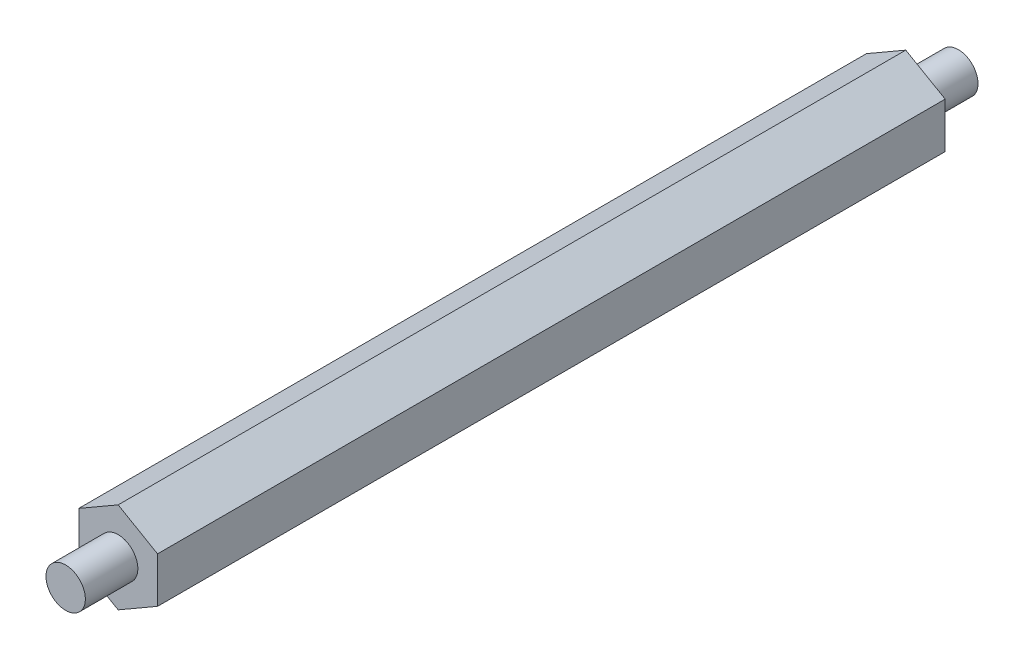
ISO-10303-21;
HEADER;
FILE_DESCRIPTION(('STEP AP214'),'2;1');
FILE_NAME('part.step','',(''),(''),'','','');
FILE_SCHEMA(('AUTOMOTIVE_DESIGN { 1 0 10303 214 1 1 1 1 }'));
ENDSEC;
DATA;
#1=APPLICATION_CONTEXT('core data for automotive mechanical design processes');
#2=APPLICATION_PROTOCOL_DEFINITION('international standard','automotive_design',2000,#1);
#3=PRODUCT_CONTEXT('',#1,'mechanical');
#4=PRODUCT('Part','Part','',(#3));
#5=PRODUCT_RELATED_PRODUCT_CATEGORY('part','',(#4));
#6=PRODUCT_DEFINITION_FORMATION('','',#4);
#7=PRODUCT_DEFINITION_CONTEXT('part definition',#1,'design');
#8=PRODUCT_DEFINITION('design','',#6,#7);
#9=PRODUCT_DEFINITION_SHAPE('','',#8);
#10=(LENGTH_UNIT() NAMED_UNIT(*) SI_UNIT(.MILLI.,.METRE.));
#11=(NAMED_UNIT(*) PLANE_ANGLE_UNIT() SI_UNIT($,.RADIAN.));
#12=(NAMED_UNIT(*) SI_UNIT($,.STERADIAN.) SOLID_ANGLE_UNIT());
#13=UNCERTAINTY_MEASURE_WITH_UNIT(LENGTH_MEASURE(1.E-05),#10,'distance_accuracy_value','');
#14=(GEOMETRIC_REPRESENTATION_CONTEXT(3) GLOBAL_UNCERTAINTY_ASSIGNED_CONTEXT((#13)) GLOBAL_UNIT_ASSIGNED_CONTEXT((#10,
#11,#12)) REPRESENTATION_CONTEXT('',''));
#15=CARTESIAN_POINT('',(0.,0.,0.));
#16=DIRECTION('',(0.,0.,1.));
#17=DIRECTION('',(1.,0.,0.));
#18=AXIS2_PLACEMENT_3D('',#15,#16,#17);
#19=CARTESIAN_POINT('',(2.08140106595602,1.86462753604946,60.));
#20=DIRECTION('',(-0.5,-0.866025403784439,0.));
#21=DIRECTION('',(0.866025403784439,-0.5,0.));
#22=AXIS2_PLACEMENT_3D('',#19,#20,#21);
#23=PLANE('',#22);
#24=DIRECTION('',(-0.866025403784439,0.5,0.));
#25=VECTOR('',#24,1.);
#26=CARTESIAN_POINT('',(2.08140106595602,1.86462753604946,0.));
#27=LINE('',#26,#25);
#28=CARTESIAN_POINT('',(2.08140106595602,1.86462753604946,0.));
#29=VERTEX_POINT('',#28);
#30=CARTESIAN_POINT('',(-0.918598934043976,3.59667834361834,0.));
#31=VERTEX_POINT('',#30);
#32=EDGE_CURVE('E117',#29,#31,#27,.T.);
#33=ORIENTED_EDGE('',*,*,#32,.T.);
#34=DIRECTION('',(0.,0.,-1.));
#35=VECTOR('',#34,1.);
#36=CARTESIAN_POINT('',(-0.918598934043976,3.59667834361834,60.));
#37=LINE('',#36,#35);
#38=CARTESIAN_POINT('',(-0.918598934043976,3.59667834361834,60.));
#39=VERTEX_POINT('',#38);
#40=EDGE_CURVE('E40',#39,#31,#37,.T.);
#41=ORIENTED_EDGE('',*,*,#40,.F.);
#42=DIRECTION('',(-0.866025403784439,0.5,0.));
#43=VECTOR('',#42,1.);
#44=CARTESIAN_POINT('',(2.08140106595602,1.86462753604946,60.));
#45=LINE('',#44,#43);
#46=CARTESIAN_POINT('',(2.08140106595602,1.86462753604946,60.));
#47=VERTEX_POINT('',#46);
#48=EDGE_CURVE('E128',#47,#39,#45,.T.);
#49=ORIENTED_EDGE('',*,*,#48,.F.);
#50=DIRECTION('',(0.,0.,-1.));
#51=VECTOR('',#50,1.);
#52=CARTESIAN_POINT('',(2.08140106595602,1.86462753604946,60.));
#53=LINE('',#52,#51);
#54=EDGE_CURVE('E113',#47,#29,#53,.T.);
#55=ORIENTED_EDGE('',*,*,#54,.T.);
#56=EDGE_LOOP('',(#33,#41,#49,#55));
#57=FACE_BOUND('',#56,.T.);
#58=ADVANCED_FACE('F32',(#57),#23,.F.);
#59=CARTESIAN_POINT('',(-0.918598934043976,3.59667834361834,60.));
#60=DIRECTION('',(0.5,-0.866025403784439,0.));
#61=DIRECTION('',(0.866025403784439,0.5,0.));
#62=AXIS2_PLACEMENT_3D('',#59,#60,#61);
#63=PLANE('',#62);
#64=DIRECTION('',(-0.866025403784439,-0.5,0.));
#65=VECTOR('',#64,1.);
#66=CARTESIAN_POINT('',(-0.918598934043976,3.59667834361834,0.));
#67=LINE('',#66,#65);
#68=CARTESIAN_POINT('',(-3.91859893404398,1.86462753604946,0.));
#69=VERTEX_POINT('',#68);
#70=EDGE_CURVE('E120',#31,#69,#67,.T.);
#71=ORIENTED_EDGE('',*,*,#70,.T.);
#72=DIRECTION('',(0.,0.,-1.));
#73=VECTOR('',#72,1.);
#74=CARTESIAN_POINT('',(-3.91859893404398,1.86462753604946,60.));
#75=LINE('',#74,#73);
#76=CARTESIAN_POINT('',(-3.91859893404398,1.86462753604946,60.));
#77=VERTEX_POINT('',#76);
#78=EDGE_CURVE('E132',#77,#69,#75,.T.);
#79=ORIENTED_EDGE('',*,*,#78,.F.);
#80=DIRECTION('',(-0.866025403784439,-0.5,0.));
#81=VECTOR('',#80,1.);
#82=CARTESIAN_POINT('',(-0.918598934043976,3.59667834361834,60.));
#83=LINE('',#82,#81);
#84=EDGE_CURVE('E86',#39,#77,#83,.T.);
#85=ORIENTED_EDGE('',*,*,#84,.F.);
#86=ORIENTED_EDGE('',*,*,#40,.T.);
#87=EDGE_LOOP('',(#71,#79,#85,#86));
#88=FACE_BOUND('',#87,.T.);
#89=ADVANCED_FACE('F135',(#88),#63,.F.);
#90=CARTESIAN_POINT('',(-3.91859893404398,1.86462753604946,60.));
#91=DIRECTION('',(1.,0.,0.));
#92=DIRECTION('',(0.,1.,0.));
#93=AXIS2_PLACEMENT_3D('',#90,#91,#92);
#94=PLANE('',#93);
#95=DIRECTION('',(0.,-1.,0.));
#96=VECTOR('',#95,1.);
#97=CARTESIAN_POINT('',(-3.91859893404398,1.86462753604946,0.));
#98=LINE('',#97,#96);
#99=CARTESIAN_POINT('',(-3.91859893404398,-1.59947407908829,0.));
#100=VERTEX_POINT('',#99);
#101=EDGE_CURVE('E123',#69,#100,#98,.T.);
#102=ORIENTED_EDGE('',*,*,#101,.T.);
#103=DIRECTION('',(0.,0.,-1.));
#104=VECTOR('',#103,1.);
#105=CARTESIAN_POINT('',(-3.91859893404398,-1.59947407908829,60.));
#106=LINE('',#105,#104);
#107=CARTESIAN_POINT('',(-3.91859893404398,-1.59947407908829,60.));
#108=VERTEX_POINT('',#107);
#109=EDGE_CURVE('E108',#108,#100,#106,.T.);
#110=ORIENTED_EDGE('',*,*,#109,.F.);
#111=DIRECTION('',(0.,-1.,0.));
#112=VECTOR('',#111,1.);
#113=CARTESIAN_POINT('',(-3.91859893404398,1.86462753604946,60.));
#114=LINE('',#113,#112);
#115=EDGE_CURVE('E99',#77,#108,#114,.T.);
#116=ORIENTED_EDGE('',*,*,#115,.F.);
#117=ORIENTED_EDGE('',*,*,#78,.T.);
#118=EDGE_LOOP('',(#102,#110,#116,#117));
#119=FACE_BOUND('',#118,.T.);
#120=ADVANCED_FACE('F143',(#119),#94,.F.);
#121=CARTESIAN_POINT('',(-3.91859893404398,-1.59947407908829,60.));
#122=DIRECTION('',(0.5,0.866025403784438,0.));
#123=DIRECTION('',(-0.866025403784439,0.5,0.));
#124=AXIS2_PLACEMENT_3D('',#121,#122,#123);
#125=PLANE('',#124);
#126=DIRECTION('',(0.866025403784438,-0.5,0.));
#127=VECTOR('',#126,1.);
#128=CARTESIAN_POINT('',(-3.91859893404398,-1.59947407908829,0.));
#129=LINE('',#128,#127);
#130=CARTESIAN_POINT('',(-0.91859893404398,-3.33152488665717,0.));
#131=VERTEX_POINT('',#130);
#132=EDGE_CURVE('E107',#100,#131,#129,.T.);
#133=ORIENTED_EDGE('',*,*,#132,.T.);
#134=DIRECTION('',(0.,0.,-1.));
#135=VECTOR('',#134,1.);
#136=CARTESIAN_POINT('',(-0.91859893404398,-3.33152488665717,60.));
#137=LINE('',#136,#135);
#138=CARTESIAN_POINT('',(-0.91859893404398,-3.33152488665717,60.));
#139=VERTEX_POINT('',#138);
#140=EDGE_CURVE('E104',#139,#131,#137,.T.);
#141=ORIENTED_EDGE('',*,*,#140,.F.);
#142=DIRECTION('',(0.866025403784438,-0.5,0.));
#143=VECTOR('',#142,1.);
#144=CARTESIAN_POINT('',(-3.91859893404398,-1.59947407908829,60.));
#145=LINE('',#144,#143);
#146=EDGE_CURVE('E93',#108,#139,#145,.T.);
#147=ORIENTED_EDGE('',*,*,#146,.F.);
#148=ORIENTED_EDGE('',*,*,#109,.T.);
#149=EDGE_LOOP('',(#133,#141,#147,#148));
#150=FACE_BOUND('',#149,.T.);
#151=ADVANCED_FACE('F105',(#150),#125,.F.);
#152=CARTESIAN_POINT('',(-0.91859893404398,-3.33152488665717,60.));
#153=DIRECTION('',(-0.5,0.866025403784438,0.));
#154=DIRECTION('',(-0.866025403784438,-0.5,0.));
#155=AXIS2_PLACEMENT_3D('',#152,#153,#154);
#156=PLANE('',#155);
#157=DIRECTION('',(0.866025403784438,0.5,0.));
#158=VECTOR('',#157,1.);
#159=CARTESIAN_POINT('',(-0.91859893404398,-3.33152488665717,0.));
#160=LINE('',#159,#158);
#161=CARTESIAN_POINT('',(2.08140106595602,-1.59947407908829,0.));
#162=VERTEX_POINT('',#161);
#163=EDGE_CURVE('E71',#131,#162,#160,.T.);
#164=ORIENTED_EDGE('',*,*,#163,.T.);
#165=DIRECTION('',(0.,0.,-1.));
#166=VECTOR('',#165,1.);
#167=CARTESIAN_POINT('',(2.08140106595602,-1.59947407908829,60.));
#168=LINE('',#167,#166);
#169=CARTESIAN_POINT('',(2.08140106595602,-1.59947407908829,60.));
#170=VERTEX_POINT('',#169);
#171=EDGE_CURVE('E109',#170,#162,#168,.T.);
#172=ORIENTED_EDGE('',*,*,#171,.F.);
#173=DIRECTION('',(0.866025403784438,0.5,0.));
#174=VECTOR('',#173,1.);
#175=CARTESIAN_POINT('',(-0.91859893404398,-3.33152488665717,60.));
#176=LINE('',#175,#174);
#177=EDGE_CURVE('E97',#139,#170,#176,.T.);
#178=ORIENTED_EDGE('',*,*,#177,.F.);
#179=ORIENTED_EDGE('',*,*,#140,.T.);
#180=EDGE_LOOP('',(#164,#172,#178,#179));
#181=FACE_BOUND('',#180,.T.);
#182=ADVANCED_FACE('F111',(#181),#156,.F.);
#183=CARTESIAN_POINT('',(2.08140106595602,-1.59947407908829,60.));
#184=DIRECTION('',(-1.,0.,0.));
#185=DIRECTION('',(0.,0.,1.));
#186=AXIS2_PLACEMENT_3D('',#183,#184,#185);
#187=PLANE('',#186);
#188=DIRECTION('',(0.,1.,0.));
#189=VECTOR('',#188,1.);
#190=CARTESIAN_POINT('',(2.08140106595602,-1.59947407908829,0.));
#191=LINE('',#190,#189);
#192=EDGE_CURVE('E77',#162,#29,#191,.T.);
#193=ORIENTED_EDGE('',*,*,#192,.T.);
#194=ORIENTED_EDGE('',*,*,#54,.F.);
#195=DIRECTION('',(0.,1.,0.));
#196=VECTOR('',#195,1.);
#197=CARTESIAN_POINT('',(2.08140106595602,-1.59947407908829,60.));
#198=LINE('',#197,#196);
#199=EDGE_CURVE('E48',#170,#47,#198,.T.);
#200=ORIENTED_EDGE('',*,*,#199,.F.);
#201=ORIENTED_EDGE('',*,*,#171,.T.);
#202=EDGE_LOOP('',(#193,#194,#200,#201));
#203=FACE_BOUND('',#202,.T.);
#204=ADVANCED_FACE('F174',(#203),#187,.F.);
#205=CARTESIAN_POINT('',(0.,0.,60.));
#206=DIRECTION('',(0.,0.,1.));
#207=DIRECTION('',(1.,0.,0.));
#208=AXIS2_PLACEMENT_3D('',#205,#206,#207);
#209=PLANE('',#208);
#210=CARTESIAN_POINT('',(-0.91859893404398,0.132576728480584,60.));
#211=DIRECTION('',(0.,0.,1.));
#212=DIRECTION('',(1.,0.,0.));
#213=AXIS2_PLACEMENT_3D('',#210,#211,#212);
#214=CIRCLE('',#213,1.5);
#215=CARTESIAN_POINT('',(0.58140106595602,0.132576728480584,60.));
#216=VERTEX_POINT('',#215);
#217=EDGE_CURVE('E147',#216,#216,#214,.T.);
#218=ORIENTED_EDGE('',*,*,#217,.F.);
#219=EDGE_LOOP('',(#218));
#220=FACE_BOUND('',#219,.T.);
#221=ORIENTED_EDGE('',*,*,#48,.T.);
#222=ORIENTED_EDGE('',*,*,#84,.T.);
#223=ORIENTED_EDGE('',*,*,#115,.T.);
#224=ORIENTED_EDGE('',*,*,#146,.T.);
#225=ORIENTED_EDGE('',*,*,#177,.T.);
#226=ORIENTED_EDGE('',*,*,#199,.T.);
#227=EDGE_LOOP('',(#221,#222,#223,#224,#225,#226));
#228=FACE_BOUND('',#227,.T.);
#229=ADVANCED_FACE('F95',(#220,#228),#209,.T.);
#230=CARTESIAN_POINT('',(0.,0.,0.));
#231=DIRECTION('',(0.,0.,1.));
#232=DIRECTION('',(1.,0.,0.));
#233=AXIS2_PLACEMENT_3D('',#230,#231,#232);
#234=PLANE('',#233);
#235=CARTESIAN_POINT('',(-0.91859893404398,0.132576728480583,0.));
#236=DIRECTION('',(0.,0.,1.));
#237=DIRECTION('',(1.,0.,0.));
#238=AXIS2_PLACEMENT_3D('',#235,#236,#237);
#239=CIRCLE('',#238,1.5);
#240=CARTESIAN_POINT('',(0.58140106595602,0.132576728480583,0.));
#241=VERTEX_POINT('',#240);
#242=EDGE_CURVE('E11',#241,#241,#239,.F.);
#243=ORIENTED_EDGE('',*,*,#242,.F.);
#244=EDGE_LOOP('',(#243));
#245=FACE_BOUND('',#244,.T.);
#246=ORIENTED_EDGE('',*,*,#32,.F.);
#247=ORIENTED_EDGE('',*,*,#192,.F.);
#248=ORIENTED_EDGE('',*,*,#163,.F.);
#249=ORIENTED_EDGE('',*,*,#132,.F.);
#250=ORIENTED_EDGE('',*,*,#101,.F.);
#251=ORIENTED_EDGE('',*,*,#70,.F.);
#252=EDGE_LOOP('',(#246,#247,#248,#249,#250,#251));
#253=FACE_BOUND('',#252,.T.);
#254=ADVANCED_FACE('F140',(#245,#253),#234,.F.);
#255=CARTESIAN_POINT('',(-0.91859893404398,0.132576728480584,64.));
#256=DIRECTION('',(0.,0.,-1.));
#257=DIRECTION('',(-1.,0.,0.));
#258=AXIS2_PLACEMENT_3D('',#255,#256,#257);
#259=CYLINDRICAL_SURFACE('',#258,1.5);
#260=CARTESIAN_POINT('',(-0.91859893404398,0.132576728480584,64.));
#261=DIRECTION('',(0.,0.,1.));
#262=DIRECTION('',(1.,0.,0.));
#263=AXIS2_PLACEMENT_3D('',#260,#261,#262);
#264=CIRCLE('',#263,1.5);
#265=CARTESIAN_POINT('',(0.58140106595602,0.132576728480584,64.));
#266=VERTEX_POINT('',#265);
#267=EDGE_CURVE('E121',#266,#266,#264,.T.);
#268=ORIENTED_EDGE('',*,*,#267,.F.);
#269=EDGE_LOOP('',(#268));
#270=FACE_BOUND('',#269,.T.);
#271=ORIENTED_EDGE('',*,*,#217,.T.);
#272=EDGE_LOOP('',(#271));
#273=FACE_BOUND('',#272,.T.);
#274=ADVANCED_FACE('F166',(#270,#273),#259,.T.);
#275=CARTESIAN_POINT('',(-0.91859893404398,0.132576728480584,64.));
#276=DIRECTION('',(0.,0.,1.));
#277=DIRECTION('',(1.,0.,0.));
#278=AXIS2_PLACEMENT_3D('',#275,#276,#277);
#279=PLANE('',#278);
#280=ORIENTED_EDGE('',*,*,#267,.T.);
#281=EDGE_LOOP('',(#280));
#282=FACE_BOUND('',#281,.T.);
#283=ADVANCED_FACE('F161',(#282),#279,.T.);
#284=CARTESIAN_POINT('',(-0.91859893404398,0.132576728480583,-4.));
#285=DIRECTION('',(0.,0.,1.));
#286=DIRECTION('',(1.,0.,0.));
#287=AXIS2_PLACEMENT_3D('',#284,#285,#286);
#288=CYLINDRICAL_SURFACE('',#287,1.5);
#289=CARTESIAN_POINT('',(-0.91859893404398,0.132576728480583,-4.));
#290=DIRECTION('',(0.,0.,-1.));
#291=DIRECTION('',(-1.,0.,0.));
#292=AXIS2_PLACEMENT_3D('',#289,#290,#291);
#293=CIRCLE('',#292,1.5);
#294=CARTESIAN_POINT('',(-2.41859893404398,0.132576728480583,-4.));
#295=VERTEX_POINT('',#294);
#296=EDGE_CURVE('E150',#295,#295,#293,.T.);
#297=ORIENTED_EDGE('',*,*,#296,.F.);
#298=EDGE_LOOP('',(#297));
#299=FACE_BOUND('',#298,.T.);
#300=ORIENTED_EDGE('',*,*,#242,.T.);
#301=EDGE_LOOP('',(#300));
#302=FACE_BOUND('',#301,.T.);
#303=ADVANCED_FACE('F158',(#299,#302),#288,.T.);
#304=CARTESIAN_POINT('',(-0.91859893404398,0.132576728480583,-4.));
#305=DIRECTION('',(0.,0.,-1.));
#306=DIRECTION('',(-1.,0.,0.));
#307=AXIS2_PLACEMENT_3D('',#304,#305,#306);
#308=PLANE('',#307);
#309=ORIENTED_EDGE('',*,*,#296,.T.);
#310=EDGE_LOOP('',(#309));
#311=FACE_BOUND('',#310,.T.);
#312=ADVANCED_FACE('F156',(#311),#308,.T.);
#313=CLOSED_SHELL('',(#58,#89,#120,#151,#182,#204,#229,#254,#274,#283,#303,#312));
#314=MANIFOLD_SOLID_BREP('B2',#313);
#315=ADVANCED_BREP_SHAPE_REPRESENTATION('',(#18,#314),#14);
#316=SHAPE_DEFINITION_REPRESENTATION(#9,#315);
ENDSEC;
END-ISO-10303-21;
